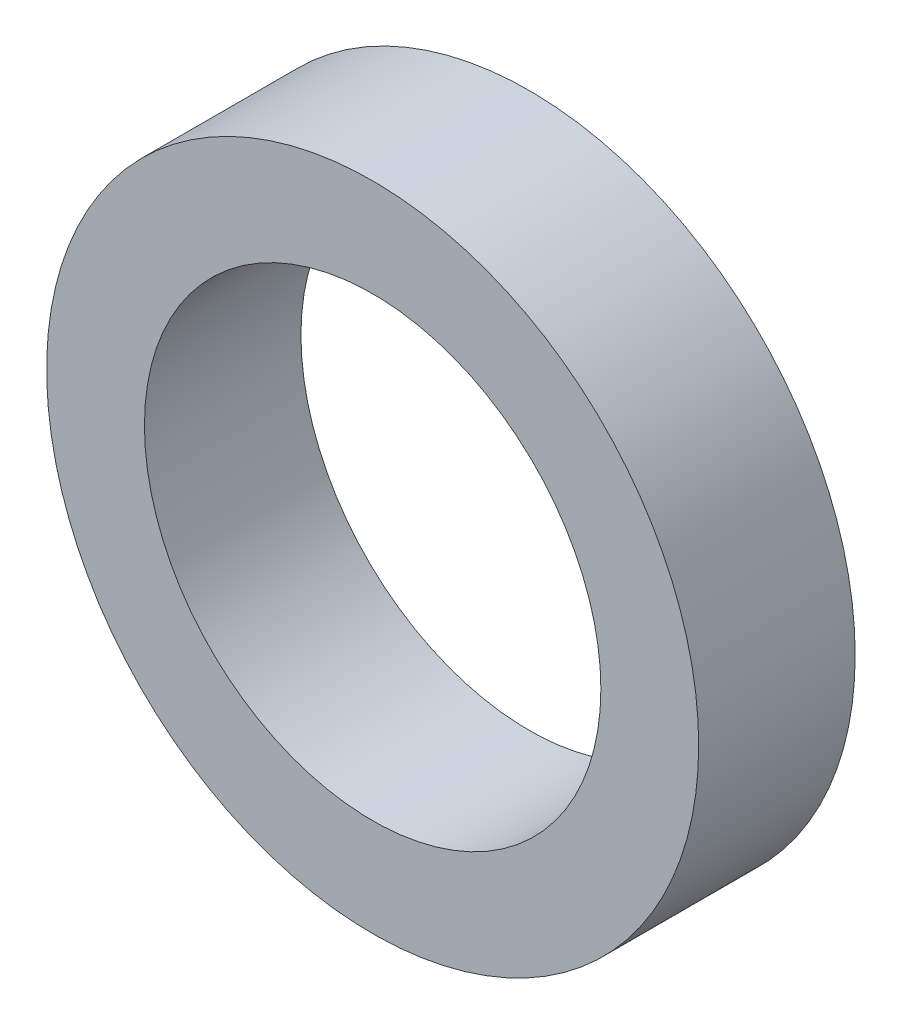
ISO-10303-21;
HEADER;
FILE_DESCRIPTION(('STEP AP214'),'2;1');
FILE_NAME('part.step','',(''),(''),'','','');
FILE_SCHEMA(('AUTOMOTIVE_DESIGN { 1 0 10303 214 1 1 1 1 }'));
ENDSEC;
DATA;
#1=APPLICATION_CONTEXT('core data for automotive mechanical design processes');
#2=APPLICATION_PROTOCOL_DEFINITION('international standard','automotive_design',2000,#1);
#3=PRODUCT_CONTEXT('',#1,'mechanical');
#4=PRODUCT('Part','Part','',(#3));
#5=PRODUCT_RELATED_PRODUCT_CATEGORY('part','',(#4));
#6=PRODUCT_DEFINITION_FORMATION('','',#4);
#7=PRODUCT_DEFINITION_CONTEXT('part definition',#1,'design');
#8=PRODUCT_DEFINITION('design','',#6,#7);
#9=PRODUCT_DEFINITION_SHAPE('','',#8);
#10=(LENGTH_UNIT() NAMED_UNIT(*) SI_UNIT(.MILLI.,.METRE.));
#11=(NAMED_UNIT(*) PLANE_ANGLE_UNIT() SI_UNIT($,.RADIAN.));
#12=(NAMED_UNIT(*) SI_UNIT($,.STERADIAN.) SOLID_ANGLE_UNIT());
#13=UNCERTAINTY_MEASURE_WITH_UNIT(LENGTH_MEASURE(1.E-05),#10,'distance_accuracy_value','');
#14=(GEOMETRIC_REPRESENTATION_CONTEXT(3) GLOBAL_UNCERTAINTY_ASSIGNED_CONTEXT((#13)) GLOBAL_UNIT_ASSIGNED_CONTEXT((#10,
#11,#12)) REPRESENTATION_CONTEXT('',''));
#15=CARTESIAN_POINT('',(0.,0.,0.));
#16=DIRECTION('',(0.,0.,1.));
#17=DIRECTION('',(1.,0.,0.));
#18=AXIS2_PLACEMENT_3D('',#15,#16,#17);
#19=CARTESIAN_POINT('',(0.,0.,-6.));
#20=DIRECTION('',(0.,0.,1.));
#21=DIRECTION('',(1.,0.,0.));
#22=AXIS2_PLACEMENT_3D('',#19,#20,#21);
#23=CYLINDRICAL_SURFACE('',#22,12.5);
#24=CARTESIAN_POINT('',(0.,0.,-6.));
#25=DIRECTION('',(0.,0.,1.));
#26=DIRECTION('',(1.,0.,0.));
#27=AXIS2_PLACEMENT_3D('',#24,#25,#26);
#28=CIRCLE('',#27,12.5);
#29=CARTESIAN_POINT('',(12.5,0.,-6.));
#30=VERTEX_POINT('',#29);
#31=EDGE_CURVE('E10',#30,#30,#28,.T.);
#32=ORIENTED_EDGE('',*,*,#31,.T.);
#33=EDGE_LOOP('',(#32));
#34=FACE_BOUND('',#33,.T.);
#35=CARTESIAN_POINT('',(0.,0.,0.));
#36=DIRECTION('',(0.,0.,1.));
#37=DIRECTION('',(1.,0.,0.));
#38=AXIS2_PLACEMENT_3D('',#35,#36,#37);
#39=CIRCLE('',#38,12.5);
#40=CARTESIAN_POINT('',(12.5,0.,0.));
#41=VERTEX_POINT('',#40);
#42=EDGE_CURVE('E33',#41,#41,#39,.T.);
#43=ORIENTED_EDGE('',*,*,#42,.F.);
#44=EDGE_LOOP('',(#43));
#45=FACE_BOUND('',#44,.T.);
#46=ADVANCED_FACE('F30',(#34,#45),#23,.T.);
#47=CARTESIAN_POINT('',(0.,0.,-6.));
#48=DIRECTION('',(0.,0.,1.));
#49=DIRECTION('',(1.,0.,0.));
#50=AXIS2_PLACEMENT_3D('',#47,#48,#49);
#51=PLANE('',#50);
#52=CARTESIAN_POINT('',(0.,0.,-6.));
#53=DIRECTION('',(0.,0.,1.));
#54=DIRECTION('',(1.,0.,0.));
#55=AXIS2_PLACEMENT_3D('',#52,#53,#54);
#56=CIRCLE('',#55,8.75);
#57=CARTESIAN_POINT('',(8.75,0.,-6.));
#58=VERTEX_POINT('',#57);
#59=EDGE_CURVE('E40',#58,#58,#56,.T.);
#60=ORIENTED_EDGE('',*,*,#59,.T.);
#61=EDGE_LOOP('',(#60));
#62=FACE_BOUND('',#61,.T.);
#63=ORIENTED_EDGE('',*,*,#31,.F.);
#64=EDGE_LOOP('',(#63));
#65=FACE_BOUND('',#64,.T.);
#66=ADVANCED_FACE('F48',(#62,#65),#51,.F.);
#67=CARTESIAN_POINT('',(0.,0.,0.));
#68=DIRECTION('',(0.,0.,1.));
#69=DIRECTION('',(1.,0.,0.));
#70=AXIS2_PLACEMENT_3D('',#67,#68,#69);
#71=PLANE('',#70);
#72=CARTESIAN_POINT('',(0.,0.,0.));
#73=DIRECTION('',(0.,0.,1.));
#74=DIRECTION('',(1.,0.,0.));
#75=AXIS2_PLACEMENT_3D('',#72,#73,#74);
#76=CIRCLE('',#75,8.75);
#77=CARTESIAN_POINT('',(8.75,0.,0.));
#78=VERTEX_POINT('',#77);
#79=EDGE_CURVE('E42',#78,#78,#76,.T.);
#80=ORIENTED_EDGE('',*,*,#79,.F.);
#81=EDGE_LOOP('',(#80));
#82=FACE_BOUND('',#81,.T.);
#83=ORIENTED_EDGE('',*,*,#42,.T.);
#84=EDGE_LOOP('',(#83));
#85=FACE_BOUND('',#84,.T.);
#86=ADVANCED_FACE('F54',(#82,#85),#71,.T.);
#87=CARTESIAN_POINT('',(0.,0.,-6.));
#88=DIRECTION('',(0.,0.,1.));
#89=DIRECTION('',(1.,0.,0.));
#90=AXIS2_PLACEMENT_3D('',#87,#88,#89);
#91=CYLINDRICAL_SURFACE('',#90,8.75);
#92=ORIENTED_EDGE('',*,*,#59,.F.);
#93=EDGE_LOOP('',(#92));
#94=FACE_BOUND('',#93,.T.);
#95=ORIENTED_EDGE('',*,*,#79,.T.);
#96=EDGE_LOOP('',(#95));
#97=FACE_BOUND('',#96,.T.);
#98=ADVANCED_FACE('F51',(#94,#97),#91,.F.);
#99=CLOSED_SHELL('',(#46,#66,#86,#98));
#100=MANIFOLD_SOLID_BREP('B2',#99);
#101=ADVANCED_BREP_SHAPE_REPRESENTATION('',(#18,#100),#14);
#102=SHAPE_DEFINITION_REPRESENTATION(#9,#101);
ENDSEC;
END-ISO-10303-21;
